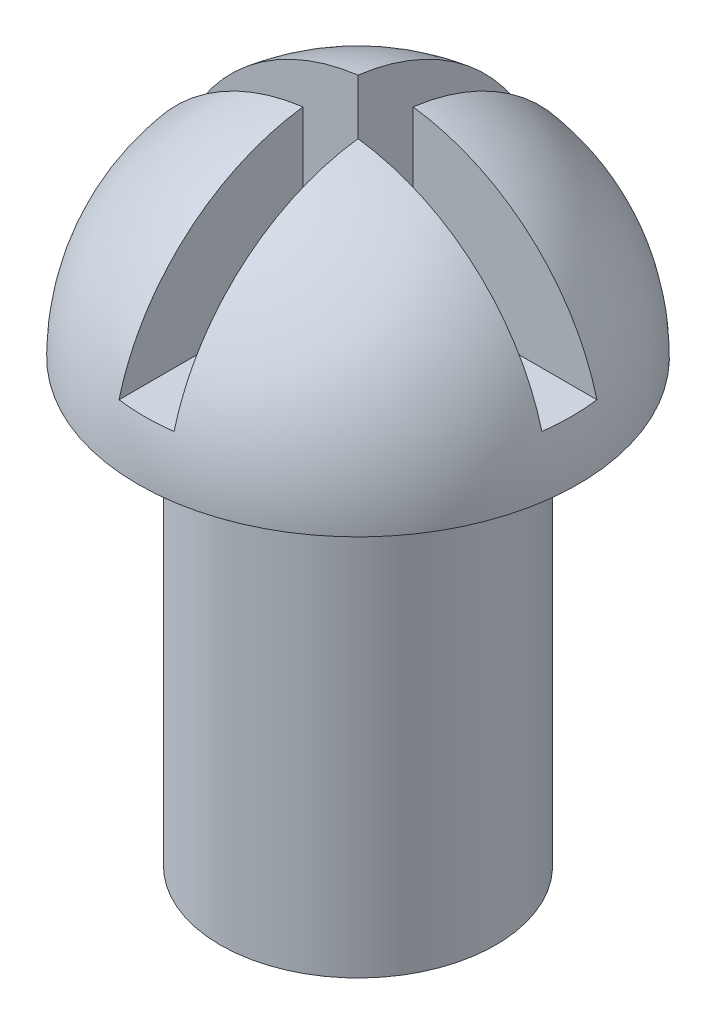
ISO-10303-21;
HEADER;
FILE_DESCRIPTION(('STEP AP214'),'2;1');
FILE_NAME('part.step','',(''),(''),'','','');
FILE_SCHEMA(('AUTOMOTIVE_DESIGN { 1 0 10303 214 1 1 1 1 }'));
ENDSEC;
DATA;
#1=APPLICATION_CONTEXT('core data for automotive mechanical design processes');
#2=APPLICATION_PROTOCOL_DEFINITION('international standard','automotive_design',2000,#1);
#3=PRODUCT_CONTEXT('',#1,'mechanical');
#4=PRODUCT('Part','Part','',(#3));
#5=PRODUCT_RELATED_PRODUCT_CATEGORY('part','',(#4));
#6=PRODUCT_DEFINITION_FORMATION('','',#4);
#7=PRODUCT_DEFINITION_CONTEXT('part definition',#1,'design');
#8=PRODUCT_DEFINITION('design','',#6,#7);
#9=PRODUCT_DEFINITION_SHAPE('','',#8);
#10=(LENGTH_UNIT() NAMED_UNIT(*) SI_UNIT(.MILLI.,.METRE.));
#11=(NAMED_UNIT(*) PLANE_ANGLE_UNIT() SI_UNIT($,.RADIAN.));
#12=(NAMED_UNIT(*) SI_UNIT($,.STERADIAN.) SOLID_ANGLE_UNIT());
#13=UNCERTAINTY_MEASURE_WITH_UNIT(LENGTH_MEASURE(1.E-05),#10,'distance_accuracy_value','');
#14=(GEOMETRIC_REPRESENTATION_CONTEXT(3) GLOBAL_UNCERTAINTY_ASSIGNED_CONTEXT((#13)) GLOBAL_UNIT_ASSIGNED_CONTEXT((#10,
#11,#12)) REPRESENTATION_CONTEXT('',''));
#15=CARTESIAN_POINT('',(0.,0.,0.));
#16=DIRECTION('',(0.,0.,1.));
#17=DIRECTION('',(1.,0.,0.));
#18=AXIS2_PLACEMENT_3D('',#15,#16,#17);
#19=CARTESIAN_POINT('',(0.,8.,0.));
#20=DIRECTION('',(0.,0.,-1.));
#21=DIRECTION('',(-1.,0.,0.));
#22=AXIS2_PLACEMENT_3D('',#19,#20,#21);
#23=SPHERICAL_SURFACE('',#22,4.);
#24=CARTESIAN_POINT('',(0.,8.,0.));
#25=DIRECTION('',(0.,-1.,0.));
#26=DIRECTION('',(0.,0.,1.));
#27=AXIS2_PLACEMENT_3D('',#24,#25,#26);
#28=CIRCLE('',#27,4.);
#29=CARTESIAN_POINT('',(0.,8.,4.));
#30=VERTEX_POINT('',#29);
#31=EDGE_CURVE('E104',#30,#30,#28,.T.);
#32=ORIENTED_EDGE('',*,*,#31,.F.);
#33=EDGE_LOOP('',(#32));
#34=FACE_BOUND('',#33,.T.);
#35=CARTESIAN_POINT('',(0.,8.,-0.5));
#36=DIRECTION('',(0.,0.,1.));
#37=DIRECTION('',(1.,0.,0.));
#38=AXIS2_PLACEMENT_3D('',#35,#36,#37);
#39=CIRCLE('',#38,3.96862696659689);
#40=CARTESIAN_POINT('',(3.84057287393431,9.,-0.5));
#41=VERTEX_POINT('',#40);
#42=CARTESIAN_POINT('',(0.5,11.9370039370059,-0.5));
#43=VERTEX_POINT('',#42);
#44=EDGE_CURVE('E11',#41,#43,#39,.T.);
#45=ORIENTED_EDGE('',*,*,#44,.F.);
#46=CARTESIAN_POINT('',(0.,9.,0.));
#47=DIRECTION('',(0.,1.,0.));
#48=DIRECTION('',(0.,0.,1.));
#49=AXIS2_PLACEMENT_3D('',#46,#47,#48);
#50=CIRCLE('',#49,3.87298334620742);
#51=CARTESIAN_POINT('',(3.84057287393431,9.,0.5));
#52=VERTEX_POINT('',#51);
#53=EDGE_CURVE('E149',#52,#41,#50,.T.);
#54=ORIENTED_EDGE('',*,*,#53,.F.);
#55=CARTESIAN_POINT('',(0.,8.,0.5));
#56=DIRECTION('',(0.,0.,-1.));
#57=DIRECTION('',(-1.,0.,0.));
#58=AXIS2_PLACEMENT_3D('',#55,#56,#57);
#59=CIRCLE('',#58,3.96862696659689);
#60=CARTESIAN_POINT('',(0.5,11.9370039370059,0.5));
#61=VERTEX_POINT('',#60);
#62=EDGE_CURVE('E156',#61,#52,#59,.T.);
#63=ORIENTED_EDGE('',*,*,#62,.F.);
#64=CARTESIAN_POINT('',(0.5,8.,0.));
#65=DIRECTION('',(-1.,0.,0.));
#66=DIRECTION('',(0.,0.,1.));
#67=AXIS2_PLACEMENT_3D('',#64,#65,#66);
#68=CIRCLE('',#67,3.96862696659689);
#69=CARTESIAN_POINT('',(0.500000000000001,9.,3.8405728739343));
#70=VERTEX_POINT('',#69);
#71=EDGE_CURVE('E148',#70,#61,#68,.T.);
#72=ORIENTED_EDGE('',*,*,#71,.F.);
#73=CARTESIAN_POINT('',(-0.5,9.,3.8405728739343));
#74=VERTEX_POINT('',#73);
#75=EDGE_CURVE('E144',#74,#70,#50,.T.);
#76=ORIENTED_EDGE('',*,*,#75,.F.);
#77=CARTESIAN_POINT('',(-0.5,8.,0.));
#78=DIRECTION('',(1.,0.,0.));
#79=DIRECTION('',(0.,0.,-1.));
#80=AXIS2_PLACEMENT_3D('',#77,#78,#79);
#81=CIRCLE('',#80,3.96862696659689);
#82=CARTESIAN_POINT('',(-0.5,11.9370039370059,0.5));
#83=VERTEX_POINT('',#82);
#84=EDGE_CURVE('E152',#83,#74,#81,.T.);
#85=ORIENTED_EDGE('',*,*,#84,.F.);
#86=CARTESIAN_POINT('',(0.,8.,0.5));
#87=DIRECTION('',(0.,0.,-1.));
#88=DIRECTION('',(-1.,0.,0.));
#89=AXIS2_PLACEMENT_3D('',#86,#87,#88);
#90=CIRCLE('',#89,3.96862696659689);
#91=CARTESIAN_POINT('',(-3.8405728739343,9.,0.5));
#92=VERTEX_POINT('',#91);
#93=EDGE_CURVE('E154',#92,#83,#90,.T.);
#94=ORIENTED_EDGE('',*,*,#93,.F.);
#95=CARTESIAN_POINT('',(-3.8405728739343,9.,-0.5));
#96=VERTEX_POINT('',#95);
#97=EDGE_CURVE('E150',#96,#92,#50,.T.);
#98=ORIENTED_EDGE('',*,*,#97,.F.);
#99=CARTESIAN_POINT('',(0.,8.,-0.5));
#100=DIRECTION('',(0.,0.,1.));
#101=DIRECTION('',(1.,0.,0.));
#102=AXIS2_PLACEMENT_3D('',#99,#100,#101);
#103=CIRCLE('',#102,3.96862696659689);
#104=CARTESIAN_POINT('',(-0.5,11.9370039370059,-0.5));
#105=VERTEX_POINT('',#104);
#106=EDGE_CURVE('E116',#105,#96,#103,.T.);
#107=ORIENTED_EDGE('',*,*,#106,.F.);
#108=CARTESIAN_POINT('',(-0.499999999999999,8.,0.));
#109=DIRECTION('',(1.,0.,0.));
#110=DIRECTION('',(0.,0.,-1.));
#111=AXIS2_PLACEMENT_3D('',#108,#109,#110);
#112=CIRCLE('',#111,3.96862696659689);
#113=CARTESIAN_POINT('',(-0.5,9.,-3.8405728739343));
#114=VERTEX_POINT('',#113);
#115=EDGE_CURVE('E57',#114,#105,#112,.T.);
#116=ORIENTED_EDGE('',*,*,#115,.F.);
#117=CARTESIAN_POINT('',(0.499999999999999,9.,-3.8405728739343));
#118=VERTEX_POINT('',#117);
#119=EDGE_CURVE('E113',#118,#114,#50,.T.);
#120=ORIENTED_EDGE('',*,*,#119,.F.);
#121=CARTESIAN_POINT('',(0.5,8.,0.));
#122=DIRECTION('',(-1.,0.,0.));
#123=DIRECTION('',(0.,0.,1.));
#124=AXIS2_PLACEMENT_3D('',#121,#122,#123);
#125=CIRCLE('',#124,3.96862696659689);
#126=EDGE_CURVE('E42',#43,#118,#125,.T.);
#127=ORIENTED_EDGE('',*,*,#126,.F.);
#128=EDGE_LOOP('',(#45,#54,#63,#72,#76,#85,#94,#98,#107,#116,#120,#127));
#129=FACE_BOUND('',#128,.T.);
#130=ADVANCED_FACE('F34',(#34,#129),#23,.T.);
#131=CARTESIAN_POINT('',(0.,8.,0.));
#132=DIRECTION('',(0.,-1.,0.));
#133=DIRECTION('',(0.,0.,-1.));
#134=AXIS2_PLACEMENT_3D('',#131,#132,#133);
#135=CYLINDRICAL_SURFACE('',#134,2.5);
#136=CARTESIAN_POINT('',(0.,8.,0.));
#137=DIRECTION('',(0.,1.,0.));
#138=DIRECTION('',(0.,0.,1.));
#139=AXIS2_PLACEMENT_3D('',#136,#137,#138);
#140=CIRCLE('',#139,2.5);
#141=CARTESIAN_POINT('',(0.,8.,2.5));
#142=VERTEX_POINT('',#141);
#143=EDGE_CURVE('E141',#142,#142,#140,.T.);
#144=ORIENTED_EDGE('',*,*,#143,.F.);
#145=EDGE_LOOP('',(#144));
#146=FACE_BOUND('',#145,.T.);
#147=CARTESIAN_POINT('',(0.,0.,0.));
#148=DIRECTION('',(0.,1.,0.));
#149=DIRECTION('',(0.,0.,1.));
#150=AXIS2_PLACEMENT_3D('',#147,#148,#149);
#151=CIRCLE('',#150,2.5);
#152=CARTESIAN_POINT('',(0.,0.,2.5));
#153=VERTEX_POINT('',#152);
#154=EDGE_CURVE('E140',#153,#153,#151,.T.);
#155=ORIENTED_EDGE('',*,*,#154,.T.);
#156=EDGE_LOOP('',(#155));
#157=FACE_BOUND('',#156,.T.);
#158=ADVANCED_FACE('F36',(#146,#157),#135,.T.);
#159=CARTESIAN_POINT('',(0.,0.,0.));
#160=DIRECTION('',(0.,1.,0.));
#161=DIRECTION('',(0.,0.,1.));
#162=AXIS2_PLACEMENT_3D('',#159,#160,#161);
#163=PLANE('',#162);
#164=ORIENTED_EDGE('',*,*,#154,.F.);
#165=EDGE_LOOP('',(#164));
#166=FACE_BOUND('',#165,.T.);
#167=ADVANCED_FACE('F194',(#166),#163,.F.);
#168=CARTESIAN_POINT('',(0.,8.,0.));
#169=DIRECTION('',(0.,-1.,0.));
#170=DIRECTION('',(0.,0.,1.));
#171=AXIS2_PLACEMENT_3D('',#168,#169,#170);
#172=PLANE('',#171);
#173=ORIENTED_EDGE('',*,*,#143,.T.);
#174=EDGE_LOOP('',(#173));
#175=FACE_BOUND('',#174,.T.);
#176=ORIENTED_EDGE('',*,*,#31,.T.);
#177=EDGE_LOOP('',(#176));
#178=FACE_BOUND('',#177,.T.);
#179=ADVANCED_FACE('F198',(#175,#178),#172,.T.);
#180=CARTESIAN_POINT('',(-0.500000000000001,12.,-4.67398282875427));
#181=DIRECTION('',(1.,0.,0.));
#182=DIRECTION('',(0.,0.,-1.));
#183=AXIS2_PLACEMENT_3D('',#180,#181,#182);
#184=PLANE('',#183);
#185=ORIENTED_EDGE('',*,*,#115,.T.);
#186=DIRECTION('',(0.,-1.,0.));
#187=VECTOR('',#186,1.);
#188=CARTESIAN_POINT('',(-0.5,12.,-0.5));
#189=LINE('',#188,#187);
#190=CARTESIAN_POINT('',(-0.5,9.,-0.5));
#191=VERTEX_POINT('',#190);
#192=EDGE_CURVE('E97',#105,#191,#189,.T.);
#193=ORIENTED_EDGE('',*,*,#192,.T.);
#194=DIRECTION('',(0.,0.,1.));
#195=VECTOR('',#194,1.);
#196=CARTESIAN_POINT('',(-0.500000000000001,9.,-4.67398282875427));
#197=LINE('',#196,#195);
#198=EDGE_CURVE('E100',#114,#191,#197,.T.);
#199=ORIENTED_EDGE('',*,*,#198,.F.);
#200=EDGE_LOOP('',(#185,#193,#199));
#201=FACE_BOUND('',#200,.T.);
#202=ADVANCED_FACE('F99',(#201),#184,.T.);
#203=CARTESIAN_POINT('',(-4.83332315246177,12.,-0.5));
#204=DIRECTION('',(0.,0.,1.));
#205=DIRECTION('',(1.,0.,0.));
#206=AXIS2_PLACEMENT_3D('',#203,#204,#205);
#207=PLANE('',#206);
#208=ORIENTED_EDGE('',*,*,#106,.T.);
#209=DIRECTION('',(-1.,0.,0.));
#210=VECTOR('',#209,1.);
#211=CARTESIAN_POINT('',(-4.83332315246177,9.,-0.5));
#212=LINE('',#211,#210);
#213=EDGE_CURVE('E109',#191,#96,#212,.T.);
#214=ORIENTED_EDGE('',*,*,#213,.F.);
#215=ORIENTED_EDGE('',*,*,#192,.F.);
#216=EDGE_LOOP('',(#208,#214,#215));
#217=FACE_BOUND('',#216,.T.);
#218=ADVANCED_FACE('F115',(#217),#207,.T.);
#219=CARTESIAN_POINT('',(-4.83332315246177,12.,0.5));
#220=DIRECTION('',(0.,0.,-1.));
#221=DIRECTION('',(-1.,0.,0.));
#222=AXIS2_PLACEMENT_3D('',#219,#220,#221);
#223=PLANE('',#222);
#224=ORIENTED_EDGE('',*,*,#93,.T.);
#225=DIRECTION('',(0.,-1.,0.));
#226=VECTOR('',#225,1.);
#227=CARTESIAN_POINT('',(-0.5,12.,0.5));
#228=LINE('',#227,#226);
#229=CARTESIAN_POINT('',(-0.5,9.,0.5));
#230=VERTEX_POINT('',#229);
#231=EDGE_CURVE('E105',#83,#230,#228,.T.);
#232=ORIENTED_EDGE('',*,*,#231,.T.);
#233=DIRECTION('',(1.,0.,0.));
#234=VECTOR('',#233,1.);
#235=CARTESIAN_POINT('',(-4.83332315246177,9.,0.5));
#236=LINE('',#235,#234);
#237=EDGE_CURVE('E117',#92,#230,#236,.T.);
#238=ORIENTED_EDGE('',*,*,#237,.F.);
#239=EDGE_LOOP('',(#224,#232,#238));
#240=FACE_BOUND('',#239,.T.);
#241=ADVANCED_FACE('F169',(#240),#223,.T.);
#242=CARTESIAN_POINT('',(-0.5,12.,0.5));
#243=DIRECTION('',(1.,0.,0.));
#244=DIRECTION('',(0.,0.,-1.));
#245=AXIS2_PLACEMENT_3D('',#242,#243,#244);
#246=PLANE('',#245);
#247=ORIENTED_EDGE('',*,*,#84,.T.);
#248=DIRECTION('',(0.,0.,1.));
#249=VECTOR('',#248,1.);
#250=CARTESIAN_POINT('',(-0.5,9.,0.5));
#251=LINE('',#250,#249);
#252=EDGE_CURVE('E49',#230,#74,#251,.T.);
#253=ORIENTED_EDGE('',*,*,#252,.F.);
#254=ORIENTED_EDGE('',*,*,#231,.F.);
#255=EDGE_LOOP('',(#247,#253,#254));
#256=FACE_BOUND('',#255,.T.);
#257=ADVANCED_FACE('F176',(#256),#246,.T.);
#258=CARTESIAN_POINT('',(0.5,12.,0.5));
#259=DIRECTION('',(-1.,0.,0.));
#260=DIRECTION('',(0.,0.,1.));
#261=AXIS2_PLACEMENT_3D('',#258,#259,#260);
#262=PLANE('',#261);
#263=ORIENTED_EDGE('',*,*,#71,.T.);
#264=DIRECTION('',(0.,-1.,0.));
#265=VECTOR('',#264,1.);
#266=CARTESIAN_POINT('',(0.5,12.,0.5));
#267=LINE('',#266,#265);
#268=CARTESIAN_POINT('',(0.5,9.,0.5));
#269=VERTEX_POINT('',#268);
#270=EDGE_CURVE('E135',#61,#269,#267,.T.);
#271=ORIENTED_EDGE('',*,*,#270,.T.);
#272=DIRECTION('',(0.,0.,-1.));
#273=VECTOR('',#272,1.);
#274=CARTESIAN_POINT('',(0.5,9.,0.5));
#275=LINE('',#274,#273);
#276=EDGE_CURVE('E122',#70,#269,#275,.T.);
#277=ORIENTED_EDGE('',*,*,#276,.F.);
#278=EDGE_LOOP('',(#263,#271,#277));
#279=FACE_BOUND('',#278,.T.);
#280=ADVANCED_FACE('F178',(#279),#262,.T.);
#281=CARTESIAN_POINT('',(0.5,12.,0.5));
#282=DIRECTION('',(0.,0.,-1.));
#283=DIRECTION('',(-1.,0.,0.));
#284=AXIS2_PLACEMENT_3D('',#281,#282,#283);
#285=PLANE('',#284);
#286=ORIENTED_EDGE('',*,*,#62,.T.);
#287=DIRECTION('',(1.,0.,0.));
#288=VECTOR('',#287,1.);
#289=CARTESIAN_POINT('',(0.5,9.,0.5));
#290=LINE('',#289,#288);
#291=EDGE_CURVE('E125',#269,#52,#290,.T.);
#292=ORIENTED_EDGE('',*,*,#291,.F.);
#293=ORIENTED_EDGE('',*,*,#270,.F.);
#294=EDGE_LOOP('',(#286,#292,#293));
#295=FACE_BOUND('',#294,.T.);
#296=ADVANCED_FACE('F184',(#295),#285,.T.);
#297=CARTESIAN_POINT('',(0.5,12.,-0.5));
#298=DIRECTION('',(0.,0.,1.));
#299=DIRECTION('',(1.,0.,0.));
#300=AXIS2_PLACEMENT_3D('',#297,#298,#299);
#301=PLANE('',#300);
#302=ORIENTED_EDGE('',*,*,#44,.T.);
#303=DIRECTION('',(0.,-1.,0.));
#304=VECTOR('',#303,1.);
#305=CARTESIAN_POINT('',(0.5,12.,-0.5));
#306=LINE('',#305,#304);
#307=CARTESIAN_POINT('',(0.5,9.,-0.5));
#308=VERTEX_POINT('',#307);
#309=EDGE_CURVE('E133',#43,#308,#306,.T.);
#310=ORIENTED_EDGE('',*,*,#309,.T.);
#311=DIRECTION('',(-1.,0.,0.));
#312=VECTOR('',#311,1.);
#313=CARTESIAN_POINT('',(0.5,9.,-0.5));
#314=LINE('',#313,#312);
#315=EDGE_CURVE('E128',#41,#308,#314,.T.);
#316=ORIENTED_EDGE('',*,*,#315,.F.);
#317=EDGE_LOOP('',(#302,#310,#316));
#318=FACE_BOUND('',#317,.T.);
#319=ADVANCED_FACE('F242',(#318),#301,.T.);
#320=CARTESIAN_POINT('',(0.499999999999999,12.,-4.67398282875427));
#321=DIRECTION('',(-1.,0.,0.));
#322=DIRECTION('',(0.,0.,1.));
#323=AXIS2_PLACEMENT_3D('',#320,#321,#322);
#324=PLANE('',#323);
#325=ORIENTED_EDGE('',*,*,#126,.T.);
#326=DIRECTION('',(0.,0.,-1.));
#327=VECTOR('',#326,1.);
#328=CARTESIAN_POINT('',(0.499999999999999,9.,-4.67398282875427));
#329=LINE('',#328,#327);
#330=EDGE_CURVE('E131',#308,#118,#329,.T.);
#331=ORIENTED_EDGE('',*,*,#330,.F.);
#332=ORIENTED_EDGE('',*,*,#309,.F.);
#333=EDGE_LOOP('',(#325,#331,#332));
#334=FACE_BOUND('',#333,.T.);
#335=ADVANCED_FACE('F252',(#334),#324,.T.);
#336=CARTESIAN_POINT('',(0.,9.,0.));
#337=DIRECTION('',(0.,1.,0.));
#338=DIRECTION('',(0.,0.,1.));
#339=AXIS2_PLACEMENT_3D('',#336,#337,#338);
#340=PLANE('',#339);
#341=ORIENTED_EDGE('',*,*,#53,.T.);
#342=ORIENTED_EDGE('',*,*,#315,.T.);
#343=ORIENTED_EDGE('',*,*,#330,.T.);
#344=ORIENTED_EDGE('',*,*,#119,.T.);
#345=ORIENTED_EDGE('',*,*,#198,.T.);
#346=ORIENTED_EDGE('',*,*,#213,.T.);
#347=ORIENTED_EDGE('',*,*,#97,.T.);
#348=ORIENTED_EDGE('',*,*,#237,.T.);
#349=ORIENTED_EDGE('',*,*,#252,.T.);
#350=ORIENTED_EDGE('',*,*,#75,.T.);
#351=ORIENTED_EDGE('',*,*,#276,.T.);
#352=ORIENTED_EDGE('',*,*,#291,.T.);
#353=EDGE_LOOP('',(#341,#342,#343,#344,#345,#346,#347,#348,#349,#350,#351,#352));
#354=FACE_BOUND('',#353,.T.);
#355=ADVANCED_FACE('F108',(#354),#340,.T.);
#356=CLOSED_SHELL('',(#130,#158,#167,#179,#202,#218,#241,#257,#280,#296,#319,#335,#355));
#357=MANIFOLD_SOLID_BREP('B2',#356);
#358=ADVANCED_BREP_SHAPE_REPRESENTATION('',(#18,#357),#14);
#359=SHAPE_DEFINITION_REPRESENTATION(#9,#358);
ENDSEC;
END-ISO-10303-21;
